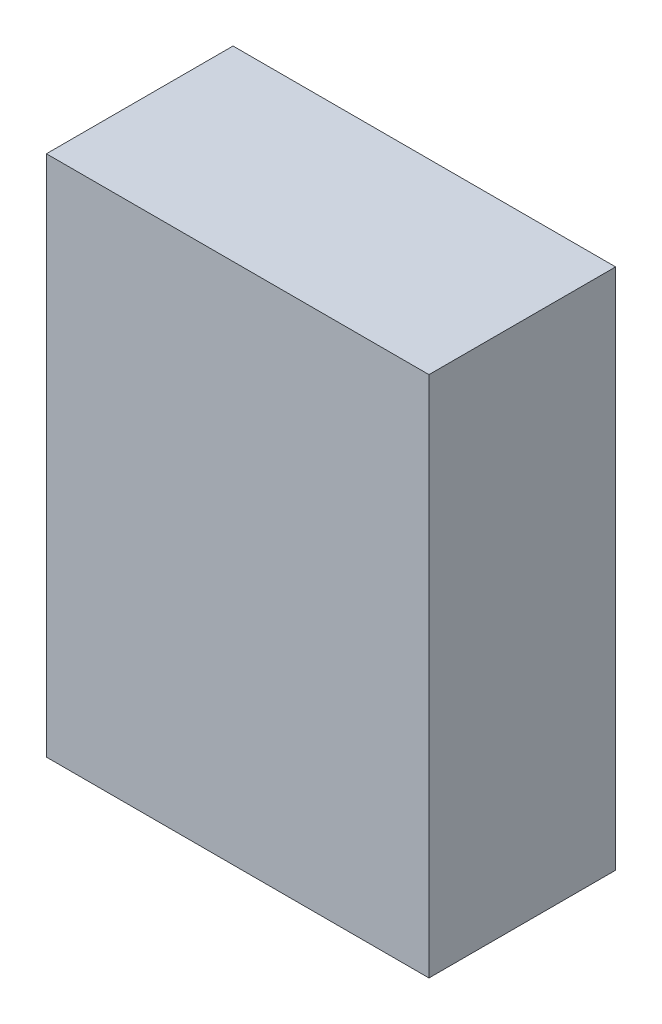
ISO-10303-21;
HEADER;
FILE_DESCRIPTION(('STEP AP214'),'2;1');
FILE_NAME('part.step','',(''),(''),'','','');
FILE_SCHEMA(('AUTOMOTIVE_DESIGN { 1 0 10303 214 1 1 1 1 }'));
ENDSEC;
DATA;
#1=APPLICATION_CONTEXT('core data for automotive mechanical design processes');
#2=APPLICATION_PROTOCOL_DEFINITION('international standard','automotive_design',2000,#1);
#3=PRODUCT_CONTEXT('',#1,'mechanical');
#4=PRODUCT('Part','Part','',(#3));
#5=PRODUCT_RELATED_PRODUCT_CATEGORY('part','',(#4));
#6=PRODUCT_DEFINITION_FORMATION('','',#4);
#7=PRODUCT_DEFINITION_CONTEXT('part definition',#1,'design');
#8=PRODUCT_DEFINITION('design','',#6,#7);
#9=PRODUCT_DEFINITION_SHAPE('','',#8);
#10=(LENGTH_UNIT() NAMED_UNIT(*) SI_UNIT(.MILLI.,.METRE.));
#11=(NAMED_UNIT(*) PLANE_ANGLE_UNIT() SI_UNIT($,.RADIAN.));
#12=(NAMED_UNIT(*) SI_UNIT($,.STERADIAN.) SOLID_ANGLE_UNIT());
#13=UNCERTAINTY_MEASURE_WITH_UNIT(LENGTH_MEASURE(1.E-05),#10,'distance_accuracy_value','');
#14=(GEOMETRIC_REPRESENTATION_CONTEXT(3) GLOBAL_UNCERTAINTY_ASSIGNED_CONTEXT((#13)) GLOBAL_UNIT_ASSIGNED_CONTEXT((#10,
#11,#12)) REPRESENTATION_CONTEXT('',''));
#15=CARTESIAN_POINT('',(0.,0.,0.));
#16=DIRECTION('',(0.,0.,1.));
#17=DIRECTION('',(1.,0.,0.));
#18=AXIS2_PLACEMENT_3D('',#15,#16,#17);
#19=CARTESIAN_POINT('',(0.,0.,0.2));
#20=DIRECTION('',(0.,0.,1.));
#21=DIRECTION('',(1.,0.,0.));
#22=AXIS2_PLACEMENT_3D('',#19,#20,#21);
#23=PLANE('',#22);
#24=DIRECTION('',(0.,-1.,0.));
#25=VECTOR('',#24,1.);
#26=CARTESIAN_POINT('',(-0.84,-2.44,0.2));
#27=LINE('',#26,#25);
#28=CARTESIAN_POINT('',(-0.84,-3.,0.2));
#29=VERTEX_POINT('',#28);
#30=CARTESIAN_POINT('',(-0.84,-2.44,0.2));
#31=VERTEX_POINT('',#30);
#32=EDGE_CURVE('E68',#29,#31,#27,.F.);
#33=ORIENTED_EDGE('',*,*,#32,.F.);
#34=DIRECTION('',(1.,0.,0.));
#35=VECTOR('',#34,1.);
#36=CARTESIAN_POINT('',(-0.84,-3.,0.2));
#37=LINE('',#36,#35);
#38=CARTESIAN_POINT('',(-0.43,-3.,0.2));
#39=VERTEX_POINT('',#38);
#40=EDGE_CURVE('E20',#39,#29,#37,.F.);
#41=ORIENTED_EDGE('',*,*,#40,.F.);
#42=DIRECTION('',(0.,1.,0.));
#43=VECTOR('',#42,1.);
#44=CARTESIAN_POINT('',(-0.43,-3.,0.2));
#45=LINE('',#44,#43);
#46=CARTESIAN_POINT('',(-0.43,-2.44,0.2));
#47=VERTEX_POINT('',#46);
#48=EDGE_CURVE('E58',#47,#39,#45,.F.);
#49=ORIENTED_EDGE('',*,*,#48,.F.);
#50=DIRECTION('',(-1.,0.,0.));
#51=VECTOR('',#50,1.);
#52=CARTESIAN_POINT('',(-0.43,-2.44,0.2));
#53=LINE('',#52,#51);
#54=EDGE_CURVE('E53',#31,#47,#53,.F.);
#55=ORIENTED_EDGE('',*,*,#54,.F.);
#56=EDGE_LOOP('',(#33,#41,#49,#55));
#57=FACE_BOUND('',#56,.T.);
#58=ADVANCED_FACE('F17',(#57),#23,.T.);
#59=CARTESIAN_POINT('',(-0.84,-3.,0.));
#60=DIRECTION('',(0.,-1.,0.));
#61=DIRECTION('',(1.,0.,0.));
#62=AXIS2_PLACEMENT_3D('',#59,#60,#61);
#63=PLANE('',#62);
#64=DIRECTION('',(0.,0.,1.));
#65=VECTOR('',#64,1.);
#66=CARTESIAN_POINT('',(-0.84,-3.,0.));
#67=LINE('',#66,#65);
#68=CARTESIAN_POINT('',(-0.84,-3.,0.));
#69=VERTEX_POINT('',#68);
#70=EDGE_CURVE('E79',#69,#29,#67,.T.);
#71=ORIENTED_EDGE('',*,*,#70,.F.);
#72=DIRECTION('',(1.,0.,0.));
#73=VECTOR('',#72,1.);
#74=CARTESIAN_POINT('',(0.,-3.,0.));
#75=LINE('',#74,#73);
#76=CARTESIAN_POINT('',(-0.43,-3.,0.));
#77=VERTEX_POINT('',#76);
#78=EDGE_CURVE('E74',#69,#77,#75,.T.);
#79=ORIENTED_EDGE('',*,*,#78,.T.);
#80=DIRECTION('',(0.,0.,1.));
#81=VECTOR('',#80,1.);
#82=CARTESIAN_POINT('',(-0.43,-3.,0.));
#83=LINE('',#82,#81);
#84=EDGE_CURVE('E63',#39,#77,#83,.F.);
#85=ORIENTED_EDGE('',*,*,#84,.F.);
#86=ORIENTED_EDGE('',*,*,#40,.T.);
#87=EDGE_LOOP('',(#71,#79,#85,#86));
#88=FACE_BOUND('',#87,.T.);
#89=ADVANCED_FACE('F73',(#88),#63,.T.);
#90=CARTESIAN_POINT('',(-0.43,-3.,0.));
#91=DIRECTION('',(1.,0.,0.));
#92=DIRECTION('',(0.,1.,0.));
#93=AXIS2_PLACEMENT_3D('',#90,#91,#92);
#94=PLANE('',#93);
#95=ORIENTED_EDGE('',*,*,#84,.T.);
#96=DIRECTION('',(0.,1.,0.));
#97=VECTOR('',#96,1.);
#98=CARTESIAN_POINT('',(-0.43,0.,0.));
#99=LINE('',#98,#97);
#100=CARTESIAN_POINT('',(-0.43,-2.44,0.));
#101=VERTEX_POINT('',#100);
#102=EDGE_CURVE('E84',#77,#101,#99,.T.);
#103=ORIENTED_EDGE('',*,*,#102,.T.);
#104=DIRECTION('',(0.,0.,1.));
#105=VECTOR('',#104,1.);
#106=CARTESIAN_POINT('',(-0.43,-2.44,0.));
#107=LINE('',#106,#105);
#108=EDGE_CURVE('E65',#47,#101,#107,.F.);
#109=ORIENTED_EDGE('',*,*,#108,.F.);
#110=ORIENTED_EDGE('',*,*,#48,.T.);
#111=EDGE_LOOP('',(#95,#103,#109,#110));
#112=FACE_BOUND('',#111,.T.);
#113=ADVANCED_FACE('F60',(#112),#94,.T.);
#114=CARTESIAN_POINT('',(-0.43,-2.44,0.));
#115=DIRECTION('',(0.,1.,0.));
#116=DIRECTION('',(-1.,0.,0.));
#117=AXIS2_PLACEMENT_3D('',#114,#115,#116);
#118=PLANE('',#117);
#119=ORIENTED_EDGE('',*,*,#108,.T.);
#120=DIRECTION('',(1.,0.,0.));
#121=VECTOR('',#120,1.);
#122=CARTESIAN_POINT('',(0.,-2.44,0.));
#123=LINE('',#122,#121);
#124=CARTESIAN_POINT('',(-0.84,-2.44,0.));
#125=VERTEX_POINT('',#124);
#126=EDGE_CURVE('E26',#101,#125,#123,.F.);
#127=ORIENTED_EDGE('',*,*,#126,.T.);
#128=DIRECTION('',(0.,0.,1.));
#129=VECTOR('',#128,1.);
#130=CARTESIAN_POINT('',(-0.84,-2.44,0.));
#131=LINE('',#130,#129);
#132=EDGE_CURVE('E34',#31,#125,#131,.F.);
#133=ORIENTED_EDGE('',*,*,#132,.F.);
#134=ORIENTED_EDGE('',*,*,#54,.T.);
#135=EDGE_LOOP('',(#119,#127,#133,#134));
#136=FACE_BOUND('',#135,.T.);
#137=ADVANCED_FACE('F88',(#136),#118,.T.);
#138=CARTESIAN_POINT('',(-0.84,-2.44,0.));
#139=DIRECTION('',(-1.,0.,0.));
#140=DIRECTION('',(0.,-1.,0.));
#141=AXIS2_PLACEMENT_3D('',#138,#139,#140);
#142=PLANE('',#141);
#143=ORIENTED_EDGE('',*,*,#132,.T.);
#144=DIRECTION('',(0.,1.,0.));
#145=VECTOR('',#144,1.);
#146=CARTESIAN_POINT('',(-0.84,0.,0.));
#147=LINE('',#146,#145);
#148=EDGE_CURVE('E11',#125,#69,#147,.F.);
#149=ORIENTED_EDGE('',*,*,#148,.T.);
#150=ORIENTED_EDGE('',*,*,#70,.T.);
#151=ORIENTED_EDGE('',*,*,#32,.T.);
#152=EDGE_LOOP('',(#143,#149,#150,#151));
#153=FACE_BOUND('',#152,.T.);
#154=ADVANCED_FACE('F91',(#153),#142,.T.);
#155=CARTESIAN_POINT('',(0.,0.,0.));
#156=DIRECTION('',(0.,0.,1.));
#157=DIRECTION('',(1.,0.,0.));
#158=AXIS2_PLACEMENT_3D('',#155,#156,#157);
#159=PLANE('',#158);
#160=ORIENTED_EDGE('',*,*,#126,.F.);
#161=ORIENTED_EDGE('',*,*,#102,.F.);
#162=ORIENTED_EDGE('',*,*,#78,.F.);
#163=ORIENTED_EDGE('',*,*,#148,.F.);
#164=EDGE_LOOP('',(#160,#161,#162,#163));
#165=FACE_BOUND('',#164,.T.);
#166=ADVANCED_FACE('F90',(#165),#159,.F.);
#167=CLOSED_SHELL('',(#58,#89,#113,#137,#154,#166));
#168=MANIFOLD_SOLID_BREP('B1',#167);
#169=ADVANCED_BREP_SHAPE_REPRESENTATION('',(#18,#168),#14);
#170=SHAPE_DEFINITION_REPRESENTATION(#9,#169);
ENDSEC;
END-ISO-10303-21;
